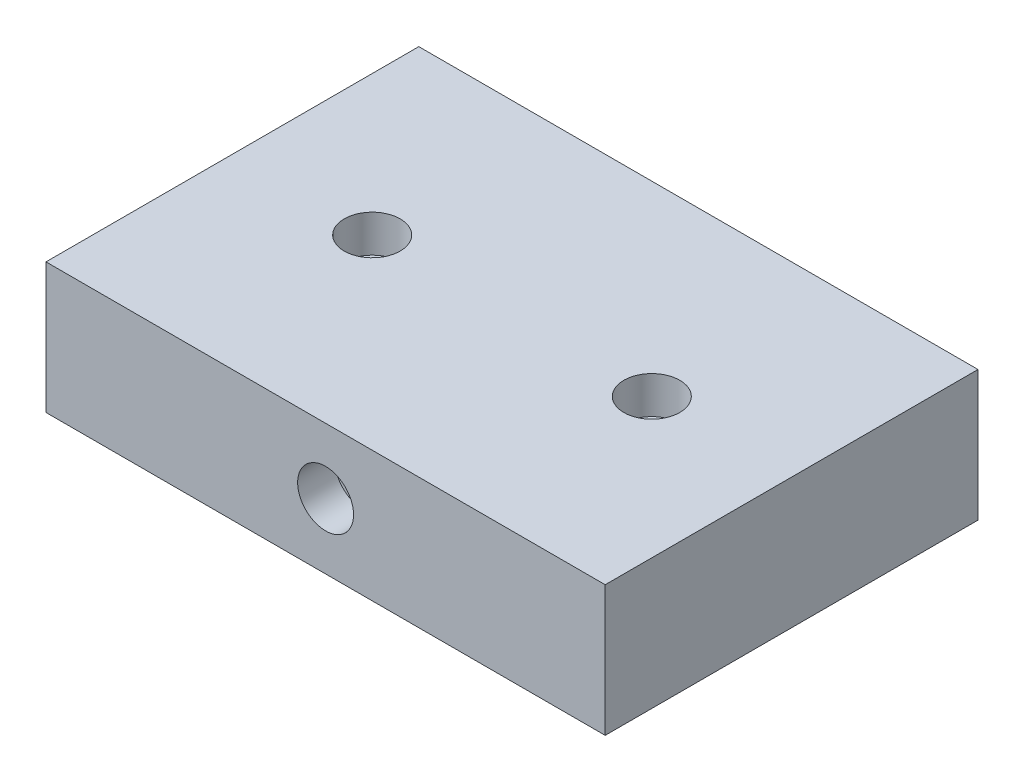
ISO-10303-21;
HEADER;
FILE_DESCRIPTION(('STEP AP214'),'2;1');
FILE_NAME('part.step','',(''),(''),'','','');
FILE_SCHEMA(('AUTOMOTIVE_DESIGN { 1 0 10303 214 1 1 1 1 }'));
ENDSEC;
DATA;
#1=APPLICATION_CONTEXT('core data for automotive mechanical design processes');
#2=APPLICATION_PROTOCOL_DEFINITION('international standard','automotive_design',2000,#1);
#3=PRODUCT_CONTEXT('',#1,'mechanical');
#4=PRODUCT('Part','Part','',(#3));
#5=PRODUCT_RELATED_PRODUCT_CATEGORY('part','',(#4));
#6=PRODUCT_DEFINITION_FORMATION('','',#4);
#7=PRODUCT_DEFINITION_CONTEXT('part definition',#1,'design');
#8=PRODUCT_DEFINITION('design','',#6,#7);
#9=PRODUCT_DEFINITION_SHAPE('','',#8);
#10=(LENGTH_UNIT() NAMED_UNIT(*) SI_UNIT(.MILLI.,.METRE.));
#11=(NAMED_UNIT(*) PLANE_ANGLE_UNIT() SI_UNIT($,.RADIAN.));
#12=(NAMED_UNIT(*) SI_UNIT($,.STERADIAN.) SOLID_ANGLE_UNIT());
#13=UNCERTAINTY_MEASURE_WITH_UNIT(LENGTH_MEASURE(1.E-05),#10,'distance_accuracy_value','');
#14=(GEOMETRIC_REPRESENTATION_CONTEXT(3) GLOBAL_UNCERTAINTY_ASSIGNED_CONTEXT((#13)) GLOBAL_UNIT_ASSIGNED_CONTEXT((#10,
#11,#12)) REPRESENTATION_CONTEXT('',''));
#15=CARTESIAN_POINT('',(0.,0.,0.));
#16=DIRECTION('',(0.,0.,1.));
#17=DIRECTION('',(1.,0.,0.));
#18=AXIS2_PLACEMENT_3D('',#15,#16,#17);
#19=CARTESIAN_POINT('',(0.,0.,20.));
#20=DIRECTION('',(1.,0.,0.));
#21=DIRECTION('',(0.,0.,-1.));
#22=AXIS2_PLACEMENT_3D('',#19,#20,#21);
#23=PLANE('',#22);
#24=DIRECTION('',(0.,-1.,0.));
#25=VECTOR('',#24,1.);
#26=CARTESIAN_POINT('',(0.,0.,0.));
#27=LINE('',#26,#25);
#28=CARTESIAN_POINT('',(0.,7.,0.));
#29=VERTEX_POINT('',#28);
#30=CARTESIAN_POINT('',(0.,0.,0.));
#31=VERTEX_POINT('',#30);
#32=EDGE_CURVE('E111',#29,#31,#27,.T.);
#33=ORIENTED_EDGE('',*,*,#32,.T.);
#34=DIRECTION('',(0.,0.,-1.));
#35=VECTOR('',#34,1.);
#36=CARTESIAN_POINT('',(0.,0.,20.));
#37=LINE('',#36,#35);
#38=CARTESIAN_POINT('',(0.,0.,20.));
#39=VERTEX_POINT('',#38);
#40=EDGE_CURVE('E11',#39,#31,#37,.T.);
#41=ORIENTED_EDGE('',*,*,#40,.F.);
#42=DIRECTION('',(0.,-1.,0.));
#43=VECTOR('',#42,1.);
#44=CARTESIAN_POINT('',(0.,0.,20.));
#45=LINE('',#44,#43);
#46=CARTESIAN_POINT('',(0.,7.,20.));
#47=VERTEX_POINT('',#46);
#48=EDGE_CURVE('E95',#47,#39,#45,.T.);
#49=ORIENTED_EDGE('',*,*,#48,.F.);
#50=DIRECTION('',(0.,0.,-1.));
#51=VECTOR('',#50,1.);
#52=CARTESIAN_POINT('',(0.,7.,20.));
#53=LINE('',#52,#51);
#54=EDGE_CURVE('E107',#47,#29,#53,.T.);
#55=ORIENTED_EDGE('',*,*,#54,.T.);
#56=EDGE_LOOP('',(#33,#41,#49,#55));
#57=FACE_BOUND('',#56,.T.);
#58=ADVANCED_FACE('F43',(#57),#23,.F.);
#59=CARTESIAN_POINT('',(0.,0.,20.));
#60=DIRECTION('',(0.,1.,0.));
#61=DIRECTION('',(0.,0.,1.));
#62=AXIS2_PLACEMENT_3D('',#59,#60,#61);
#63=PLANE('',#62);
#64=DIRECTION('',(1.,0.,0.));
#65=VECTOR('',#64,1.);
#66=CARTESIAN_POINT('',(0.,0.,0.));
#67=LINE('',#66,#65);
#68=CARTESIAN_POINT('',(30.,0.,0.));
#69=VERTEX_POINT('',#68);
#70=EDGE_CURVE('E100',#31,#69,#67,.T.);
#71=ORIENTED_EDGE('',*,*,#70,.T.);
#72=DIRECTION('',(0.,0.,-1.));
#73=VECTOR('',#72,1.);
#74=CARTESIAN_POINT('',(30.,0.,20.));
#75=LINE('',#74,#73);
#76=CARTESIAN_POINT('',(30.,0.,20.));
#77=VERTEX_POINT('',#76);
#78=EDGE_CURVE('E52',#77,#69,#75,.T.);
#79=ORIENTED_EDGE('',*,*,#78,.F.);
#80=DIRECTION('',(1.,0.,0.));
#81=VECTOR('',#80,1.);
#82=CARTESIAN_POINT('',(0.,0.,20.));
#83=LINE('',#82,#81);
#84=EDGE_CURVE('E90',#39,#77,#83,.T.);
#85=ORIENTED_EDGE('',*,*,#84,.F.);
#86=ORIENTED_EDGE('',*,*,#40,.T.);
#87=EDGE_LOOP('',(#71,#79,#85,#86));
#88=FACE_BOUND('',#87,.T.);
#89=ADVANCED_FACE('F99',(#88),#63,.F.);
#90=CARTESIAN_POINT('',(30.,0.,20.));
#91=DIRECTION('',(-1.,0.,0.));
#92=DIRECTION('',(0.,0.,1.));
#93=AXIS2_PLACEMENT_3D('',#90,#91,#92);
#94=PLANE('',#93);
#95=DIRECTION('',(0.,1.,0.));
#96=VECTOR('',#95,1.);
#97=CARTESIAN_POINT('',(30.,0.,0.));
#98=LINE('',#97,#96);
#99=CARTESIAN_POINT('',(30.,7.,0.));
#100=VERTEX_POINT('',#99);
#101=EDGE_CURVE('E77',#69,#100,#98,.T.);
#102=ORIENTED_EDGE('',*,*,#101,.T.);
#103=DIRECTION('',(0.,0.,-1.));
#104=VECTOR('',#103,1.);
#105=CARTESIAN_POINT('',(30.,7.,20.));
#106=LINE('',#105,#104);
#107=CARTESIAN_POINT('',(30.,7.,20.));
#108=VERTEX_POINT('',#107);
#109=EDGE_CURVE('E102',#108,#100,#106,.T.);
#110=ORIENTED_EDGE('',*,*,#109,.F.);
#111=DIRECTION('',(0.,1.,0.));
#112=VECTOR('',#111,1.);
#113=CARTESIAN_POINT('',(30.,0.,20.));
#114=LINE('',#113,#112);
#115=EDGE_CURVE('E93',#77,#108,#114,.T.);
#116=ORIENTED_EDGE('',*,*,#115,.F.);
#117=ORIENTED_EDGE('',*,*,#78,.T.);
#118=EDGE_LOOP('',(#102,#110,#116,#117));
#119=FACE_BOUND('',#118,.T.);
#120=ADVANCED_FACE('F103',(#119),#94,.F.);
#121=CARTESIAN_POINT('',(0.,7.,20.));
#122=DIRECTION('',(0.,-1.,0.));
#123=DIRECTION('',(0.,0.,-1.));
#124=AXIS2_PLACEMENT_3D('',#121,#122,#123);
#125=PLANE('',#124);
#126=CARTESIAN_POINT('',(7.5,7.,10.));
#127=DIRECTION('',(0.,1.,0.));
#128=DIRECTION('',(0.,0.,1.));
#129=AXIS2_PLACEMENT_3D('',#126,#127,#128);
#130=CIRCLE('',#129,1.5);
#131=CARTESIAN_POINT('',(7.5,7.,11.5));
#132=VERTEX_POINT('',#131);
#133=EDGE_CURVE('E148',#132,#132,#130,.T.);
#134=ORIENTED_EDGE('',*,*,#133,.F.);
#135=EDGE_LOOP('',(#134));
#136=FACE_BOUND('',#135,.T.);
#137=CARTESIAN_POINT('',(22.5,7.,10.));
#138=DIRECTION('',(0.,1.,0.));
#139=DIRECTION('',(0.,0.,1.));
#140=AXIS2_PLACEMENT_3D('',#137,#138,#139);
#141=CIRCLE('',#140,1.5);
#142=CARTESIAN_POINT('',(22.5,7.,11.5));
#143=VERTEX_POINT('',#142);
#144=EDGE_CURVE('E144',#143,#143,#141,.T.);
#145=ORIENTED_EDGE('',*,*,#144,.F.);
#146=EDGE_LOOP('',(#145));
#147=FACE_BOUND('',#146,.T.);
#148=DIRECTION('',(-1.,0.,0.));
#149=VECTOR('',#148,1.);
#150=CARTESIAN_POINT('',(0.,7.,0.));
#151=LINE('',#150,#149);
#152=EDGE_CURVE('E83',#100,#29,#151,.T.);
#153=ORIENTED_EDGE('',*,*,#152,.T.);
#154=ORIENTED_EDGE('',*,*,#54,.F.);
#155=DIRECTION('',(-1.,0.,0.));
#156=VECTOR('',#155,1.);
#157=CARTESIAN_POINT('',(0.,7.,20.));
#158=LINE('',#157,#156);
#159=EDGE_CURVE('E60',#108,#47,#158,.T.);
#160=ORIENTED_EDGE('',*,*,#159,.F.);
#161=ORIENTED_EDGE('',*,*,#109,.T.);
#162=EDGE_LOOP('',(#153,#154,#160,#161));
#163=FACE_BOUND('',#162,.T.);
#164=ADVANCED_FACE('F125',(#136,#147,#163),#125,.F.);
#165=CARTESIAN_POINT('',(0.,0.,20.));
#166=DIRECTION('',(0.,0.,-1.));
#167=DIRECTION('',(-1.,0.,0.));
#168=AXIS2_PLACEMENT_3D('',#165,#166,#167);
#169=PLANE('',#168);
#170=CARTESIAN_POINT('',(15.,3.5,20.));
#171=DIRECTION('',(0.,0.,1.));
#172=DIRECTION('',(1.,0.,0.));
#173=AXIS2_PLACEMENT_3D('',#170,#171,#172);
#174=CIRCLE('',#173,1.5);
#175=CARTESIAN_POINT('',(16.5,3.5,20.));
#176=VERTEX_POINT('',#175);
#177=EDGE_CURVE('E132',#176,#176,#174,.T.);
#178=ORIENTED_EDGE('',*,*,#177,.F.);
#179=EDGE_LOOP('',(#178));
#180=FACE_BOUND('',#179,.T.);
#181=ORIENTED_EDGE('',*,*,#48,.T.);
#182=ORIENTED_EDGE('',*,*,#84,.T.);
#183=ORIENTED_EDGE('',*,*,#115,.T.);
#184=ORIENTED_EDGE('',*,*,#159,.T.);
#185=EDGE_LOOP('',(#181,#182,#183,#184));
#186=FACE_BOUND('',#185,.T.);
#187=ADVANCED_FACE('F91',(#180,#186),#169,.F.);
#188=CARTESIAN_POINT('',(0.,0.,0.));
#189=DIRECTION('',(0.,0.,-1.));
#190=DIRECTION('',(-1.,0.,0.));
#191=AXIS2_PLACEMENT_3D('',#188,#189,#190);
#192=PLANE('',#191);
#193=ORIENTED_EDGE('',*,*,#32,.F.);
#194=ORIENTED_EDGE('',*,*,#152,.F.);
#195=ORIENTED_EDGE('',*,*,#101,.F.);
#196=ORIENTED_EDGE('',*,*,#70,.F.);
#197=EDGE_LOOP('',(#193,#194,#195,#196));
#198=FACE_BOUND('',#197,.T.);
#199=ADVANCED_FACE('F128',(#198),#192,.T.);
#200=CARTESIAN_POINT('',(15.,3.5,18.));
#201=DIRECTION('',(0.,0.,1.));
#202=DIRECTION('',(1.,0.,0.));
#203=AXIS2_PLACEMENT_3D('',#200,#201,#202);
#204=CYLINDRICAL_SURFACE('',#203,1.5);
#205=CARTESIAN_POINT('',(15.,3.5,18.));
#206=DIRECTION('',(0.,0.,1.));
#207=DIRECTION('',(1.,0.,0.));
#208=AXIS2_PLACEMENT_3D('',#205,#206,#207);
#209=CIRCLE('',#208,1.5);
#210=CARTESIAN_POINT('',(16.5,3.5,18.));
#211=VERTEX_POINT('',#210);
#212=EDGE_CURVE('E115',#211,#211,#209,.T.);
#213=ORIENTED_EDGE('',*,*,#212,.F.);
#214=EDGE_LOOP('',(#213));
#215=FACE_BOUND('',#214,.T.);
#216=ORIENTED_EDGE('',*,*,#177,.T.);
#217=EDGE_LOOP('',(#216));
#218=FACE_BOUND('',#217,.T.);
#219=ADVANCED_FACE('F181',(#215,#218),#204,.F.);
#220=CARTESIAN_POINT('',(15.,3.5,18.));
#221=DIRECTION('',(0.,0.,1.));
#222=DIRECTION('',(1.,0.,0.));
#223=AXIS2_PLACEMENT_3D('',#220,#221,#222);
#224=PLANE('',#223);
#225=ORIENTED_EDGE('',*,*,#212,.T.);
#226=EDGE_LOOP('',(#225));
#227=FACE_BOUND('',#226,.T.);
#228=ADVANCED_FACE('F172',(#227),#224,.T.);
#229=CARTESIAN_POINT('',(22.5,5.,10.));
#230=DIRECTION('',(0.,1.,0.));
#231=DIRECTION('',(0.,0.,1.));
#232=AXIS2_PLACEMENT_3D('',#229,#230,#231);
#233=CYLINDRICAL_SURFACE('',#232,1.5);
#234=CARTESIAN_POINT('',(22.5,5.,10.));
#235=DIRECTION('',(0.,1.,0.));
#236=DIRECTION('',(0.,0.,1.));
#237=AXIS2_PLACEMENT_3D('',#234,#235,#236);
#238=CIRCLE('',#237,1.5);
#239=CARTESIAN_POINT('',(22.5,5.,11.5));
#240=VERTEX_POINT('',#239);
#241=EDGE_CURVE('E140',#240,#240,#238,.T.);
#242=ORIENTED_EDGE('',*,*,#241,.F.);
#243=EDGE_LOOP('',(#242));
#244=FACE_BOUND('',#243,.T.);
#245=ORIENTED_EDGE('',*,*,#144,.T.);
#246=EDGE_LOOP('',(#245));
#247=FACE_BOUND('',#246,.T.);
#248=ADVANCED_FACE('F170',(#244,#247),#233,.F.);
#249=CARTESIAN_POINT('',(22.5,5.,10.));
#250=DIRECTION('',(0.,1.,0.));
#251=DIRECTION('',(0.,0.,1.));
#252=AXIS2_PLACEMENT_3D('',#249,#250,#251);
#253=PLANE('',#252);
#254=ORIENTED_EDGE('',*,*,#241,.T.);
#255=EDGE_LOOP('',(#254));
#256=FACE_BOUND('',#255,.T.);
#257=ADVANCED_FACE('F161',(#256),#253,.T.);
#258=CARTESIAN_POINT('',(7.5,5.,10.));
#259=DIRECTION('',(0.,1.,0.));
#260=DIRECTION('',(0.,0.,1.));
#261=AXIS2_PLACEMENT_3D('',#258,#259,#260);
#262=CYLINDRICAL_SURFACE('',#261,1.5);
#263=CARTESIAN_POINT('',(7.5,5.,10.));
#264=DIRECTION('',(0.,1.,0.));
#265=DIRECTION('',(0.,0.,1.));
#266=AXIS2_PLACEMENT_3D('',#263,#264,#265);
#267=CIRCLE('',#266,1.5);
#268=CARTESIAN_POINT('',(7.5,5.,11.5));
#269=VERTEX_POINT('',#268);
#270=EDGE_CURVE('E136',#269,#269,#267,.T.);
#271=ORIENTED_EDGE('',*,*,#270,.F.);
#272=EDGE_LOOP('',(#271));
#273=FACE_BOUND('',#272,.T.);
#274=ORIENTED_EDGE('',*,*,#133,.T.);
#275=EDGE_LOOP('',(#274));
#276=FACE_BOUND('',#275,.T.);
#277=ADVANCED_FACE('F158',(#273,#276),#262,.F.);
#278=CARTESIAN_POINT('',(7.5,5.,10.));
#279=DIRECTION('',(0.,1.,0.));
#280=DIRECTION('',(0.,0.,1.));
#281=AXIS2_PLACEMENT_3D('',#278,#279,#280);
#282=PLANE('',#281);
#283=ORIENTED_EDGE('',*,*,#270,.T.);
#284=EDGE_LOOP('',(#283));
#285=FACE_BOUND('',#284,.T.);
#286=ADVANCED_FACE('F156',(#285),#282,.T.);
#287=CLOSED_SHELL('',(#58,#89,#120,#164,#187,#199,#219,#228,#248,#257,#277,#286));
#288=MANIFOLD_SOLID_BREP('B2',#287);
#289=ADVANCED_BREP_SHAPE_REPRESENTATION('',(#18,#288),#14);
#290=SHAPE_DEFINITION_REPRESENTATION(#9,#289);
ENDSEC;
END-ISO-10303-21;
